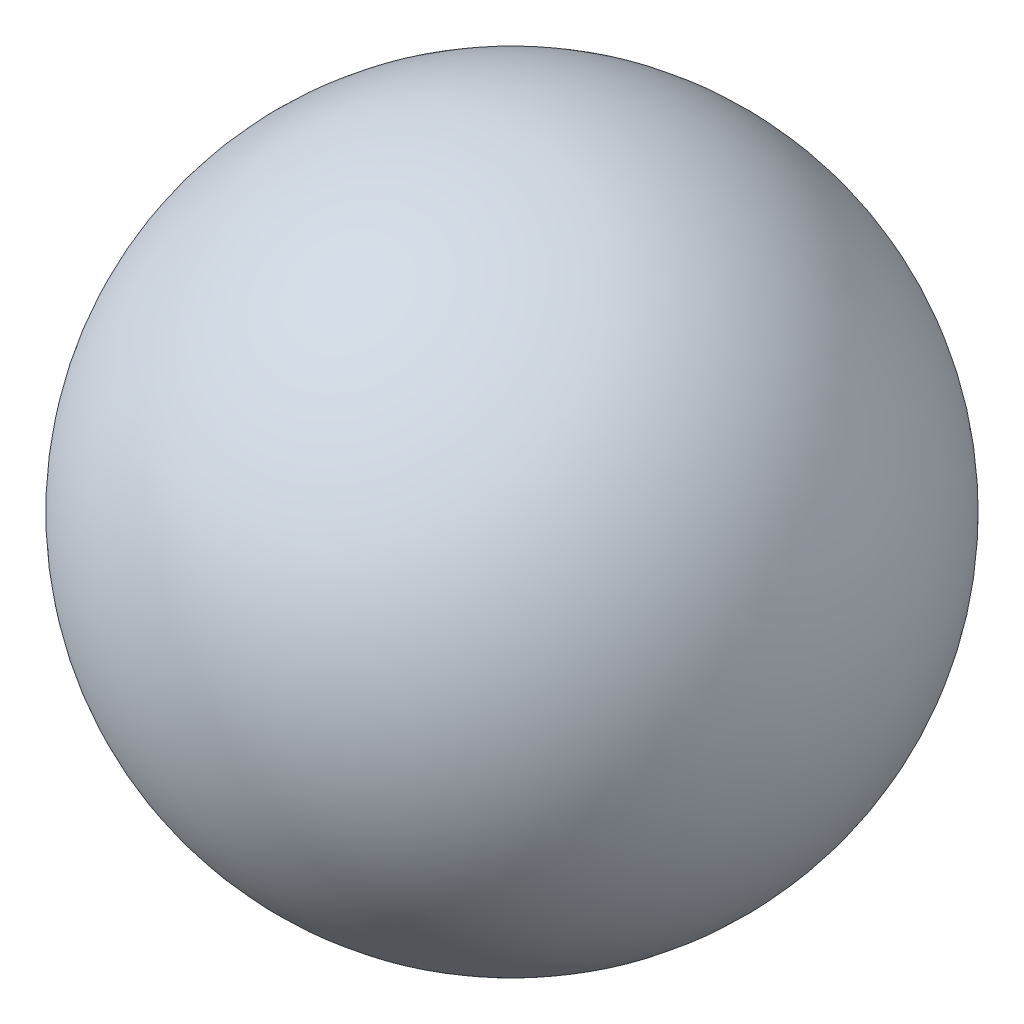
ISO-10303-21;
HEADER;
FILE_DESCRIPTION(('STEP AP214'),'2;1');
FILE_NAME('part.step','',(''),(''),'','','');
FILE_SCHEMA(('AUTOMOTIVE_DESIGN { 1 0 10303 214 1 1 1 1 }'));
ENDSEC;
DATA;
#1=APPLICATION_CONTEXT('core data for automotive mechanical design processes');
#2=APPLICATION_PROTOCOL_DEFINITION('international standard','automotive_design',2000,#1);
#3=PRODUCT_CONTEXT('',#1,'mechanical');
#4=PRODUCT('Part','Part','',(#3));
#5=PRODUCT_RELATED_PRODUCT_CATEGORY('part','',(#4));
#6=PRODUCT_DEFINITION_FORMATION('','',#4);
#7=PRODUCT_DEFINITION_CONTEXT('part definition',#1,'design');
#8=PRODUCT_DEFINITION('design','',#6,#7);
#9=PRODUCT_DEFINITION_SHAPE('','',#8);
#10=(LENGTH_UNIT() NAMED_UNIT(*) SI_UNIT(.MILLI.,.METRE.));
#11=(NAMED_UNIT(*) PLANE_ANGLE_UNIT() SI_UNIT($,.RADIAN.));
#12=(NAMED_UNIT(*) SI_UNIT($,.STERADIAN.) SOLID_ANGLE_UNIT());
#13=UNCERTAINTY_MEASURE_WITH_UNIT(LENGTH_MEASURE(1.E-05),#10,'distance_accuracy_value','');
#14=(GEOMETRIC_REPRESENTATION_CONTEXT(3) GLOBAL_UNCERTAINTY_ASSIGNED_CONTEXT((#13)) GLOBAL_UNIT_ASSIGNED_CONTEXT((#10,
#11,#12)) REPRESENTATION_CONTEXT('',''));
#15=CARTESIAN_POINT('',(0.,0.,0.));
#16=DIRECTION('',(0.,0.,1.));
#17=DIRECTION('',(1.,0.,0.));
#18=AXIS2_PLACEMENT_3D('',#15,#16,#17);
#19=CARTESIAN_POINT('',(0.,0.,0.));
#20=DIRECTION('',(0.,-1.,0.));
#21=DIRECTION('',(-1.,0.,0.));
#22=AXIS2_PLACEMENT_3D('',#19,#20,#21);
#23=SPHERICAL_SURFACE('',#22,76.);
#24=CARTESIAN_POINT('',(0.,-76.,0.));
#25=VERTEX_POINT('',#24);
#26=VERTEX_LOOP('',#25);
#27=FACE_BOUND('',#26,.T.);
#28=ADVANCED_FACE('F34',(#27),#23,.T.);
#29=CLOSED_SHELL('',(#28));
#30=MANIFOLD_SOLID_BREP('B2',#29);
#31=ADVANCED_BREP_SHAPE_REPRESENTATION('',(#18,#30),#14);
#32=SHAPE_DEFINITION_REPRESENTATION(#9,#31);
ENDSEC;
END-ISO-10303-21;
